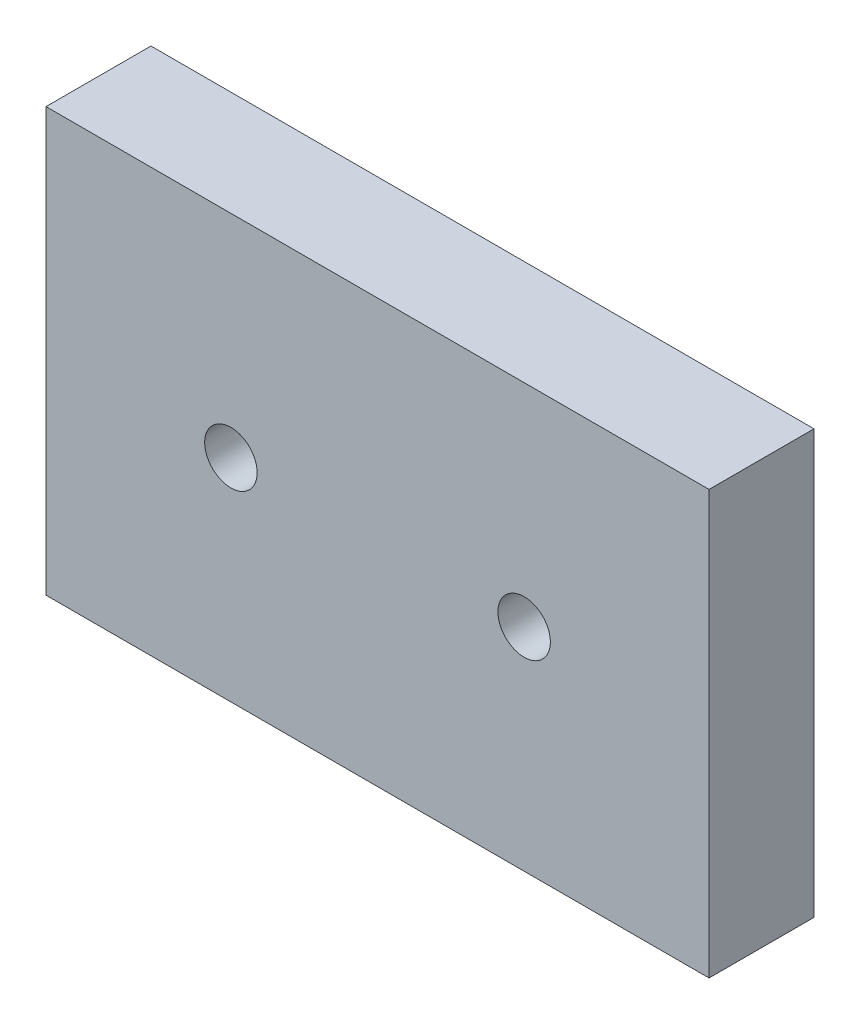
ISO-10303-21;
HEADER;
FILE_DESCRIPTION(('STEP AP214'),'2;1');
FILE_NAME('part.step','',(''),(''),'','','');
FILE_SCHEMA(('AUTOMOTIVE_DESIGN { 1 0 10303 214 1 1 1 1 }'));
ENDSEC;
DATA;
#1=APPLICATION_CONTEXT('core data for automotive mechanical design processes');
#2=APPLICATION_PROTOCOL_DEFINITION('international standard','automotive_design',2000,#1);
#3=PRODUCT_CONTEXT('',#1,'mechanical');
#4=PRODUCT('Part','Part','',(#3));
#5=PRODUCT_RELATED_PRODUCT_CATEGORY('part','',(#4));
#6=PRODUCT_DEFINITION_FORMATION('','',#4);
#7=PRODUCT_DEFINITION_CONTEXT('part definition',#1,'design');
#8=PRODUCT_DEFINITION('design','',#6,#7);
#9=PRODUCT_DEFINITION_SHAPE('','',#8);
#10=(LENGTH_UNIT() NAMED_UNIT(*) SI_UNIT(.MILLI.,.METRE.));
#11=(NAMED_UNIT(*) PLANE_ANGLE_UNIT() SI_UNIT($,.RADIAN.));
#12=(NAMED_UNIT(*) SI_UNIT($,.STERADIAN.) SOLID_ANGLE_UNIT());
#13=UNCERTAINTY_MEASURE_WITH_UNIT(LENGTH_MEASURE(1.E-05),#10,'distance_accuracy_value','');
#14=(GEOMETRIC_REPRESENTATION_CONTEXT(3) GLOBAL_UNCERTAINTY_ASSIGNED_CONTEXT((#13)) GLOBAL_UNIT_ASSIGNED_CONTEXT((#10,
#11,#12)) REPRESENTATION_CONTEXT('',''));
#15=CARTESIAN_POINT('',(0.,0.,0.));
#16=DIRECTION('',(0.,0.,1.));
#17=DIRECTION('',(1.,0.,0.));
#18=AXIS2_PLACEMENT_3D('',#15,#16,#17);
#19=CARTESIAN_POINT('',(0.,0.,10.));
#20=DIRECTION('',(0.,0.,1.));
#21=DIRECTION('',(1.,0.,0.));
#22=AXIS2_PLACEMENT_3D('',#19,#20,#21);
#23=PLANE('',#22);
#24=CARTESIAN_POINT('',(35.56,10.1599999999999,10.));
#25=DIRECTION('',(0.,0.,1.));
#26=DIRECTION('',(1.,0.,0.));
#27=AXIS2_PLACEMENT_3D('',#24,#25,#26);
#28=CIRCLE('',#27,2.5);
#29=CARTESIAN_POINT('',(38.06,10.1599999999999,10.));
#30=VERTEX_POINT('',#29);
#31=EDGE_CURVE('E112',#30,#30,#28,.T.);
#32=ORIENTED_EDGE('',*,*,#31,.F.);
#33=EDGE_LOOP('',(#32));
#34=FACE_BOUND('',#33,.T.);
#35=DIRECTION('',(-1.,0.,0.));
#36=VECTOR('',#35,1.);
#37=CARTESIAN_POINT('',(53.18,30.32,10.));
#38=LINE('',#37,#36);
#39=CARTESIAN_POINT('',(53.18,30.32,10.));
#40=VERTEX_POINT('',#39);
#41=CARTESIAN_POINT('',(-10.,30.32,10.));
#42=VERTEX_POINT('',#41);
#43=EDGE_CURVE('E92',#40,#42,#38,.T.);
#44=ORIENTED_EDGE('',*,*,#43,.T.);
#45=DIRECTION('',(0.,-1.,0.));
#46=VECTOR('',#45,1.);
#47=CARTESIAN_POINT('',(-10.,30.32,10.));
#48=LINE('',#47,#46);
#49=CARTESIAN_POINT('',(-10.,-10.,10.));
#50=VERTEX_POINT('',#49);
#51=EDGE_CURVE('E87',#42,#50,#48,.T.);
#52=ORIENTED_EDGE('',*,*,#51,.T.);
#53=DIRECTION('',(1.,0.,0.));
#54=VECTOR('',#53,1.);
#55=CARTESIAN_POINT('',(-10.,-10.,10.));
#56=LINE('',#55,#54);
#57=CARTESIAN_POINT('',(53.18,-10.,10.));
#58=VERTEX_POINT('',#57);
#59=EDGE_CURVE('E90',#50,#58,#56,.T.);
#60=ORIENTED_EDGE('',*,*,#59,.T.);
#61=DIRECTION('',(0.,1.,0.));
#62=VECTOR('',#61,1.);
#63=CARTESIAN_POINT('',(53.18,-10.,10.));
#64=LINE('',#63,#62);
#65=EDGE_CURVE('E57',#58,#40,#64,.T.);
#66=ORIENTED_EDGE('',*,*,#65,.T.);
#67=EDGE_LOOP('',(#44,#52,#60,#66));
#68=FACE_BOUND('',#67,.T.);
#69=CARTESIAN_POINT('',(7.62,10.16,10.));
#70=DIRECTION('',(0.,0.,1.));
#71=DIRECTION('',(1.,0.,0.));
#72=AXIS2_PLACEMENT_3D('',#69,#70,#71);
#73=CIRCLE('',#72,2.5);
#74=CARTESIAN_POINT('',(10.12,10.16,10.));
#75=VERTEX_POINT('',#74);
#76=EDGE_CURVE('E134',#75,#75,#73,.T.);
#77=ORIENTED_EDGE('',*,*,#76,.F.);
#78=EDGE_LOOP('',(#77));
#79=FACE_BOUND('',#78,.T.);
#80=ADVANCED_FACE('F39',(#34,#68,#79),#23,.T.);
#81=CARTESIAN_POINT('',(0.,0.,0.));
#82=DIRECTION('',(0.,0.,1.));
#83=DIRECTION('',(1.,0.,0.));
#84=AXIS2_PLACEMENT_3D('',#81,#82,#83);
#85=PLANE('',#84);
#86=DIRECTION('',(-1.,0.,0.));
#87=VECTOR('',#86,1.);
#88=CARTESIAN_POINT('',(53.18,30.32,0.));
#89=LINE('',#88,#87);
#90=CARTESIAN_POINT('',(53.18,30.32,0.));
#91=VERTEX_POINT('',#90);
#92=CARTESIAN_POINT('',(-10.,30.32,0.));
#93=VERTEX_POINT('',#92);
#94=EDGE_CURVE('E108',#91,#93,#89,.T.);
#95=ORIENTED_EDGE('',*,*,#94,.F.);
#96=DIRECTION('',(0.,1.,0.));
#97=VECTOR('',#96,1.);
#98=CARTESIAN_POINT('',(53.18,-10.,0.));
#99=LINE('',#98,#97);
#100=CARTESIAN_POINT('',(53.18,-10.,0.));
#101=VERTEX_POINT('',#100);
#102=EDGE_CURVE('E80',#101,#91,#99,.T.);
#103=ORIENTED_EDGE('',*,*,#102,.F.);
#104=DIRECTION('',(1.,0.,0.));
#105=VECTOR('',#104,1.);
#106=CARTESIAN_POINT('',(-10.,-10.,0.));
#107=LINE('',#106,#105);
#108=CARTESIAN_POINT('',(-10.,-10.,0.));
#109=VERTEX_POINT('',#108);
#110=EDGE_CURVE('E74',#109,#101,#107,.T.);
#111=ORIENTED_EDGE('',*,*,#110,.F.);
#112=DIRECTION('',(0.,-1.,0.));
#113=VECTOR('',#112,1.);
#114=CARTESIAN_POINT('',(-10.,30.32,0.));
#115=LINE('',#114,#113);
#116=EDGE_CURVE('E97',#93,#109,#115,.T.);
#117=ORIENTED_EDGE('',*,*,#116,.F.);
#118=EDGE_LOOP('',(#95,#103,#111,#117));
#119=FACE_BOUND('',#118,.T.);
#120=CARTESIAN_POINT('',(35.56,10.1599999999999,0.));
#121=DIRECTION('',(0.,0.,1.));
#122=DIRECTION('',(1.,0.,0.));
#123=AXIS2_PLACEMENT_3D('',#120,#121,#122);
#124=CIRCLE('',#123,2.5);
#125=CARTESIAN_POINT('',(38.06,10.1599999999999,0.));
#126=VERTEX_POINT('',#125);
#127=EDGE_CURVE('E130',#126,#126,#124,.T.);
#128=ORIENTED_EDGE('',*,*,#127,.T.);
#129=EDGE_LOOP('',(#128));
#130=FACE_BOUND('',#129,.T.);
#131=CARTESIAN_POINT('',(7.62,10.16,0.));
#132=DIRECTION('',(0.,0.,1.));
#133=DIRECTION('',(1.,0.,0.));
#134=AXIS2_PLACEMENT_3D('',#131,#132,#133);
#135=CIRCLE('',#134,2.5);
#136=CARTESIAN_POINT('',(10.12,10.16,0.));
#137=VERTEX_POINT('',#136);
#138=EDGE_CURVE('E138',#137,#137,#135,.T.);
#139=ORIENTED_EDGE('',*,*,#138,.T.);
#140=EDGE_LOOP('',(#139));
#141=FACE_BOUND('',#140,.T.);
#142=ADVANCED_FACE('F125',(#119,#130,#141),#85,.F.);
#143=CARTESIAN_POINT('',(53.18,30.32,10.));
#144=DIRECTION('',(0.,-1.,0.));
#145=DIRECTION('',(0.,0.,-1.));
#146=AXIS2_PLACEMENT_3D('',#143,#144,#145);
#147=PLANE('',#146);
#148=ORIENTED_EDGE('',*,*,#94,.T.);
#149=DIRECTION('',(0.,0.,-1.));
#150=VECTOR('',#149,1.);
#151=CARTESIAN_POINT('',(-10.,30.32,10.));
#152=LINE('',#151,#150);
#153=EDGE_CURVE('E11',#42,#93,#152,.T.);
#154=ORIENTED_EDGE('',*,*,#153,.F.);
#155=ORIENTED_EDGE('',*,*,#43,.F.);
#156=DIRECTION('',(0.,0.,-1.));
#157=VECTOR('',#156,1.);
#158=CARTESIAN_POINT('',(53.18,30.32,10.));
#159=LINE('',#158,#157);
#160=EDGE_CURVE('E104',#40,#91,#159,.T.);
#161=ORIENTED_EDGE('',*,*,#160,.T.);
#162=EDGE_LOOP('',(#148,#154,#155,#161));
#163=FACE_BOUND('',#162,.T.);
#164=ADVANCED_FACE('F41',(#163),#147,.F.);
#165=CARTESIAN_POINT('',(-10.,30.32,10.));
#166=DIRECTION('',(1.,0.,0.));
#167=DIRECTION('',(0.,0.,-1.));
#168=AXIS2_PLACEMENT_3D('',#165,#166,#167);
#169=PLANE('',#168);
#170=ORIENTED_EDGE('',*,*,#116,.T.);
#171=DIRECTION('',(0.,0.,-1.));
#172=VECTOR('',#171,1.);
#173=CARTESIAN_POINT('',(-10.,-10.,10.));
#174=LINE('',#173,#172);
#175=EDGE_CURVE('E49',#50,#109,#174,.T.);
#176=ORIENTED_EDGE('',*,*,#175,.F.);
#177=ORIENTED_EDGE('',*,*,#51,.F.);
#178=ORIENTED_EDGE('',*,*,#153,.T.);
#179=EDGE_LOOP('',(#170,#176,#177,#178));
#180=FACE_BOUND('',#179,.T.);
#181=ADVANCED_FACE('F96',(#180),#169,.F.);
#182=CARTESIAN_POINT('',(-10.,-10.,10.));
#183=DIRECTION('',(0.,1.,0.));
#184=DIRECTION('',(0.,0.,1.));
#185=AXIS2_PLACEMENT_3D('',#182,#183,#184);
#186=PLANE('',#185);
#187=ORIENTED_EDGE('',*,*,#110,.T.);
#188=DIRECTION('',(0.,0.,-1.));
#189=VECTOR('',#188,1.);
#190=CARTESIAN_POINT('',(53.18,-10.,10.));
#191=LINE('',#190,#189);
#192=EDGE_CURVE('E99',#58,#101,#191,.T.);
#193=ORIENTED_EDGE('',*,*,#192,.F.);
#194=ORIENTED_EDGE('',*,*,#59,.F.);
#195=ORIENTED_EDGE('',*,*,#175,.T.);
#196=EDGE_LOOP('',(#187,#193,#194,#195));
#197=FACE_BOUND('',#196,.T.);
#198=ADVANCED_FACE('F100',(#197),#186,.F.);
#199=CARTESIAN_POINT('',(53.18,-10.,10.));
#200=DIRECTION('',(-1.,0.,0.));
#201=DIRECTION('',(0.,0.,1.));
#202=AXIS2_PLACEMENT_3D('',#199,#200,#201);
#203=PLANE('',#202);
#204=ORIENTED_EDGE('',*,*,#102,.T.);
#205=ORIENTED_EDGE('',*,*,#160,.F.);
#206=ORIENTED_EDGE('',*,*,#65,.F.);
#207=ORIENTED_EDGE('',*,*,#192,.T.);
#208=EDGE_LOOP('',(#204,#205,#206,#207));
#209=FACE_BOUND('',#208,.T.);
#210=ADVANCED_FACE('F122',(#209),#203,.F.);
#211=CARTESIAN_POINT('',(35.56,10.1599999999999,10.));
#212=DIRECTION('',(0.,0.,-1.));
#213=DIRECTION('',(-1.,0.,0.));
#214=AXIS2_PLACEMENT_3D('',#211,#212,#213);
#215=CYLINDRICAL_SURFACE('',#214,2.5);
#216=ORIENTED_EDGE('',*,*,#31,.T.);
#217=EDGE_LOOP('',(#216));
#218=FACE_BOUND('',#217,.T.);
#219=ORIENTED_EDGE('',*,*,#127,.F.);
#220=EDGE_LOOP('',(#219));
#221=FACE_BOUND('',#220,.T.);
#222=ADVANCED_FACE('F157',(#218,#221),#215,.F.);
#223=CARTESIAN_POINT('',(7.62,10.16,10.));
#224=DIRECTION('',(0.,0.,-1.));
#225=DIRECTION('',(-1.,0.,0.));
#226=AXIS2_PLACEMENT_3D('',#223,#224,#225);
#227=CYLINDRICAL_SURFACE('',#226,2.5);
#228=ORIENTED_EDGE('',*,*,#76,.T.);
#229=EDGE_LOOP('',(#228));
#230=FACE_BOUND('',#229,.T.);
#231=ORIENTED_EDGE('',*,*,#138,.F.);
#232=EDGE_LOOP('',(#231));
#233=FACE_BOUND('',#232,.T.);
#234=ADVANCED_FACE('F146',(#230,#233),#227,.F.);
#235=CLOSED_SHELL('',(#80,#142,#164,#181,#198,#210,#222,#234));
#236=MANIFOLD_SOLID_BREP('B2',#235);
#237=ADVANCED_BREP_SHAPE_REPRESENTATION('',(#18,#236),#14);
#238=SHAPE_DEFINITION_REPRESENTATION(#9,#237);
ENDSEC;
END-ISO-10303-21;
